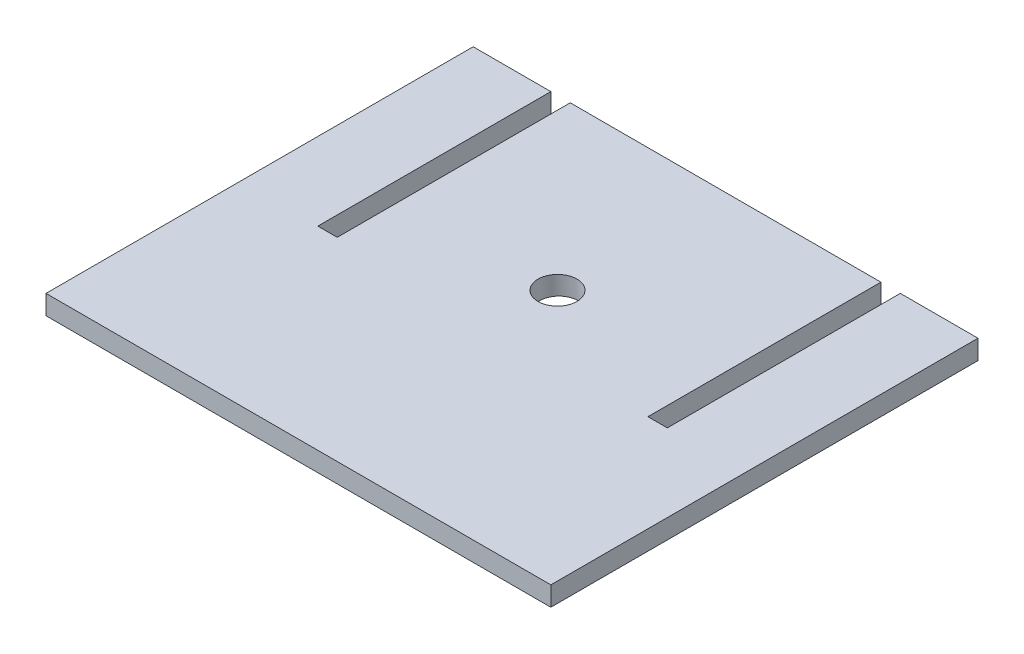
ISO-10303-21;
HEADER;
FILE_DESCRIPTION(('STEP AP214'),'2;1');
FILE_NAME('part.step','',(''),(''),'','','');
FILE_SCHEMA(('AUTOMOTIVE_DESIGN { 1 0 10303 214 1 1 1 1 }'));
ENDSEC;
DATA;
#1=APPLICATION_CONTEXT('core data for automotive mechanical design processes');
#2=APPLICATION_PROTOCOL_DEFINITION('international standard','automotive_design',2000,#1);
#3=PRODUCT_CONTEXT('',#1,'mechanical');
#4=PRODUCT('Part','Part','',(#3));
#5=PRODUCT_RELATED_PRODUCT_CATEGORY('part','',(#4));
#6=PRODUCT_DEFINITION_FORMATION('','',#4);
#7=PRODUCT_DEFINITION_CONTEXT('part definition',#1,'design');
#8=PRODUCT_DEFINITION('design','',#6,#7);
#9=PRODUCT_DEFINITION_SHAPE('','',#8);
#10=(LENGTH_UNIT() NAMED_UNIT(*) SI_UNIT(.MILLI.,.METRE.));
#11=(NAMED_UNIT(*) PLANE_ANGLE_UNIT() SI_UNIT($,.RADIAN.));
#12=(NAMED_UNIT(*) SI_UNIT($,.STERADIAN.) SOLID_ANGLE_UNIT());
#13=UNCERTAINTY_MEASURE_WITH_UNIT(LENGTH_MEASURE(1.E-05),#10,'distance_accuracy_value','');
#14=(GEOMETRIC_REPRESENTATION_CONTEXT(3) GLOBAL_UNCERTAINTY_ASSIGNED_CONTEXT((#13)) GLOBAL_UNIT_ASSIGNED_CONTEXT((#10,
#11,#12)) REPRESENTATION_CONTEXT('',''));
#15=CARTESIAN_POINT('',(0.,0.,0.));
#16=DIRECTION('',(0.,0.,1.));
#17=DIRECTION('',(1.,0.,0.));
#18=AXIS2_PLACEMENT_3D('',#15,#16,#17);
#19=CARTESIAN_POINT('',(-165.1,6.35,-139.7));
#20=DIRECTION('',(0.,0.,1.));
#21=DIRECTION('',(1.,0.,0.));
#22=AXIS2_PLACEMENT_3D('',#19,#20,#21);
#23=PLANE('',#22);
#24=DIRECTION('',(-1.,0.,0.));
#25=VECTOR('',#24,1.);
#26=CARTESIAN_POINT('',(-165.1,6.35,-139.7));
#27=LINE('',#26,#25);
#28=CARTESIAN_POINT('',(-114.3,6.35,-139.7));
#29=VERTEX_POINT('',#28);
#30=CARTESIAN_POINT('',(-165.1,6.35,-139.7));
#31=VERTEX_POINT('',#30);
#32=EDGE_CURVE('E233',#29,#31,#27,.T.);
#33=ORIENTED_EDGE('',*,*,#32,.F.);
#34=DIRECTION('',(0.,1.,0.));
#35=VECTOR('',#34,1.);
#36=CARTESIAN_POINT('',(-114.3,-6.35,-139.7));
#37=LINE('',#36,#35);
#38=CARTESIAN_POINT('',(-114.3,-6.35,-139.7));
#39=VERTEX_POINT('',#38);
#40=EDGE_CURVE('E212',#39,#29,#37,.T.);
#41=ORIENTED_EDGE('',*,*,#40,.F.);
#42=DIRECTION('',(-1.,0.,0.));
#43=VECTOR('',#42,1.);
#44=CARTESIAN_POINT('',(-165.1,-6.35,-139.7));
#45=LINE('',#44,#43);
#46=CARTESIAN_POINT('',(-165.1,-6.35,-139.7));
#47=VERTEX_POINT('',#46);
#48=EDGE_CURVE('E257',#39,#47,#45,.T.);
#49=ORIENTED_EDGE('',*,*,#48,.T.);
#50=DIRECTION('',(0.,-1.,0.));
#51=VECTOR('',#50,1.);
#52=CARTESIAN_POINT('',(-165.1,6.35,-139.7));
#53=LINE('',#52,#51);
#54=EDGE_CURVE('E239',#31,#47,#53,.T.);
#55=ORIENTED_EDGE('',*,*,#54,.F.);
#56=EDGE_LOOP('',(#33,#41,#49,#55));
#57=FACE_BOUND('',#56,.T.);
#58=ADVANCED_FACE('F44',(#57),#23,.F.);
#59=CARTESIAN_POINT('',(165.1,-6.35,-139.7));
#60=VERTEX_POINT('',#59);
#61=CARTESIAN_POINT('',(114.3,-6.35,-139.7));
#62=VERTEX_POINT('',#61);
#63=EDGE_CURVE('E204',#60,#62,#45,.T.);
#64=ORIENTED_EDGE('',*,*,#63,.T.);
#65=DIRECTION('',(0.,1.,0.));
#66=VECTOR('',#65,1.);
#67=CARTESIAN_POINT('',(114.3,-6.35,-139.7));
#68=LINE('',#67,#66);
#69=CARTESIAN_POINT('',(114.3,6.35,-139.7));
#70=VERTEX_POINT('',#69);
#71=EDGE_CURVE('E199',#62,#70,#68,.T.);
#72=ORIENTED_EDGE('',*,*,#71,.T.);
#73=CARTESIAN_POINT('',(165.1,6.35,-139.7));
#74=VERTEX_POINT('',#73);
#75=EDGE_CURVE('E231',#74,#70,#27,.T.);
#76=ORIENTED_EDGE('',*,*,#75,.F.);
#77=DIRECTION('',(0.,-1.,0.));
#78=VECTOR('',#77,1.);
#79=CARTESIAN_POINT('',(165.1,6.35,-139.7));
#80=LINE('',#79,#78);
#81=EDGE_CURVE('E203',#74,#60,#80,.T.);
#82=ORIENTED_EDGE('',*,*,#81,.T.);
#83=EDGE_LOOP('',(#64,#72,#76,#82));
#84=FACE_BOUND('',#83,.T.);
#85=ADVANCED_FACE('F281',(#84),#23,.F.);
#86=CARTESIAN_POINT('',(165.1,6.35,139.7));
#87=DIRECTION('',(-1.,0.,0.));
#88=DIRECTION('',(0.,0.,1.));
#89=AXIS2_PLACEMENT_3D('',#86,#87,#88);
#90=PLANE('',#89);
#91=DIRECTION('',(0.,0.,-1.));
#92=VECTOR('',#91,1.);
#93=CARTESIAN_POINT('',(165.1,-6.35,139.7));
#94=LINE('',#93,#92);
#95=CARTESIAN_POINT('',(165.1,-6.35,139.7));
#96=VERTEX_POINT('',#95);
#97=EDGE_CURVE('E238',#96,#60,#94,.T.);
#98=ORIENTED_EDGE('',*,*,#97,.T.);
#99=ORIENTED_EDGE('',*,*,#81,.F.);
#100=DIRECTION('',(0.,0.,-1.));
#101=VECTOR('',#100,1.);
#102=CARTESIAN_POINT('',(165.1,6.35,139.7));
#103=LINE('',#102,#101);
#104=CARTESIAN_POINT('',(165.1,6.35,139.7));
#105=VERTEX_POINT('',#104);
#106=EDGE_CURVE('E263',#105,#74,#103,.T.);
#107=ORIENTED_EDGE('',*,*,#106,.F.);
#108=DIRECTION('',(0.,-1.,0.));
#109=VECTOR('',#108,1.);
#110=CARTESIAN_POINT('',(165.1,6.35,139.7));
#111=LINE('',#110,#109);
#112=EDGE_CURVE('E247',#105,#96,#111,.T.);
#113=ORIENTED_EDGE('',*,*,#112,.T.);
#114=EDGE_LOOP('',(#98,#99,#107,#113));
#115=FACE_BOUND('',#114,.T.);
#116=ADVANCED_FACE('F278',(#115),#90,.F.);
#117=CARTESIAN_POINT('',(101.6,-6.35,-139.7));
#118=VERTEX_POINT('',#117);
#119=CARTESIAN_POINT('',(-101.6,-6.35,-139.7));
#120=VERTEX_POINT('',#119);
#121=EDGE_CURVE('E175',#118,#120,#45,.T.);
#122=ORIENTED_EDGE('',*,*,#121,.T.);
#123=DIRECTION('',(0.,1.,0.));
#124=VECTOR('',#123,1.);
#125=CARTESIAN_POINT('',(-101.6,-6.35,-139.7));
#126=LINE('',#125,#124);
#127=CARTESIAN_POINT('',(-101.6,6.35,-139.7));
#128=VERTEX_POINT('',#127);
#129=EDGE_CURVE('E79',#120,#128,#126,.T.);
#130=ORIENTED_EDGE('',*,*,#129,.T.);
#131=CARTESIAN_POINT('',(101.6,6.35,-139.7));
#132=VERTEX_POINT('',#131);
#133=EDGE_CURVE('E225',#132,#128,#27,.T.);
#134=ORIENTED_EDGE('',*,*,#133,.F.);
#135=DIRECTION('',(0.,1.,0.));
#136=VECTOR('',#135,1.);
#137=CARTESIAN_POINT('',(101.6,-6.35,-139.7));
#138=LINE('',#137,#136);
#139=EDGE_CURVE('E191',#118,#132,#138,.T.);
#140=ORIENTED_EDGE('',*,*,#139,.F.);
#141=EDGE_LOOP('',(#122,#130,#134,#140));
#142=FACE_BOUND('',#141,.T.);
#143=ADVANCED_FACE('F297',(#142),#23,.F.);
#144=CARTESIAN_POINT('',(-165.1,6.35,139.7));
#145=DIRECTION('',(1.,0.,0.));
#146=DIRECTION('',(0.,0.,-1.));
#147=AXIS2_PLACEMENT_3D('',#144,#145,#146);
#148=PLANE('',#147);
#149=DIRECTION('',(0.,0.,1.));
#150=VECTOR('',#149,1.);
#151=CARTESIAN_POINT('',(-165.1,-6.35,139.7));
#152=LINE('',#151,#150);
#153=CARTESIAN_POINT('',(-165.1,-6.35,139.7));
#154=VERTEX_POINT('',#153);
#155=EDGE_CURVE('E211',#47,#154,#152,.T.);
#156=ORIENTED_EDGE('',*,*,#155,.T.);
#157=DIRECTION('',(0.,-1.,0.));
#158=VECTOR('',#157,1.);
#159=CARTESIAN_POINT('',(-165.1,6.35,139.7));
#160=LINE('',#159,#158);
#161=CARTESIAN_POINT('',(-165.1,6.35,139.7));
#162=VERTEX_POINT('',#161);
#163=EDGE_CURVE('E243',#162,#154,#160,.T.);
#164=ORIENTED_EDGE('',*,*,#163,.F.);
#165=DIRECTION('',(0.,0.,1.));
#166=VECTOR('',#165,1.);
#167=CARTESIAN_POINT('',(-165.1,6.35,139.7));
#168=LINE('',#167,#166);
#169=EDGE_CURVE('E264',#31,#162,#168,.T.);
#170=ORIENTED_EDGE('',*,*,#169,.F.);
#171=ORIENTED_EDGE('',*,*,#54,.T.);
#172=EDGE_LOOP('',(#156,#164,#170,#171));
#173=FACE_BOUND('',#172,.T.);
#174=ADVANCED_FACE('F291',(#173),#148,.F.);
#175=CARTESIAN_POINT('',(-165.1,6.35,139.7));
#176=DIRECTION('',(0.,0.,-1.));
#177=DIRECTION('',(-1.,0.,0.));
#178=AXIS2_PLACEMENT_3D('',#175,#176,#177);
#179=PLANE('',#178);
#180=DIRECTION('',(1.,0.,0.));
#181=VECTOR('',#180,1.);
#182=CARTESIAN_POINT('',(-165.1,-6.35,139.7));
#183=LINE('',#182,#181);
#184=EDGE_CURVE('E242',#154,#96,#183,.T.);
#185=ORIENTED_EDGE('',*,*,#184,.T.);
#186=ORIENTED_EDGE('',*,*,#112,.F.);
#187=DIRECTION('',(1.,0.,0.));
#188=VECTOR('',#187,1.);
#189=CARTESIAN_POINT('',(-165.1,6.35,139.7));
#190=LINE('',#189,#188);
#191=EDGE_CURVE('E260',#162,#105,#190,.T.);
#192=ORIENTED_EDGE('',*,*,#191,.F.);
#193=ORIENTED_EDGE('',*,*,#163,.T.);
#194=EDGE_LOOP('',(#185,#186,#192,#193));
#195=FACE_BOUND('',#194,.T.);
#196=ADVANCED_FACE('F287',(#195),#179,.F.);
#197=CARTESIAN_POINT('',(0.,6.35,0.));
#198=DIRECTION('',(0.,-1.,0.));
#199=DIRECTION('',(0.,0.,-1.));
#200=AXIS2_PLACEMENT_3D('',#197,#198,#199);
#201=PLANE('',#200);
#202=CARTESIAN_POINT('',(0.420618124772805,6.34999999999999,-29.3287996232021));
#203=DIRECTION('',(0.,-1.,0.));
#204=DIRECTION('',(-0.0668404015347865,0.,0.99776367979731));
#205=AXIS2_PLACEMENT_3D('',#202,#203,#204);
#206=ELLIPSE('',#205,12.7300984739161,12.7000000000001);
#207=CARTESIAN_POINT('',(-0.430266768801122,6.34999999999999,-16.6271697256854));
#208=VERTEX_POINT('',#207);
#209=EDGE_CURVE('E11',#208,#208,#206,.F.);
#210=ORIENTED_EDGE('',*,*,#209,.F.);
#211=EDGE_LOOP('',(#210));
#212=FACE_BOUND('',#211,.T.);
#213=DIRECTION('',(1.,0.,0.));
#214=VECTOR('',#213,1.);
#215=CARTESIAN_POINT('',(-114.3,6.35,12.7));
#216=LINE('',#215,#214);
#217=CARTESIAN_POINT('',(-114.3,6.35,12.7));
#218=VERTEX_POINT('',#217);
#219=CARTESIAN_POINT('',(-101.6,6.35,12.7));
#220=VERTEX_POINT('',#219);
#221=EDGE_CURVE('E206',#218,#220,#216,.T.);
#222=ORIENTED_EDGE('',*,*,#221,.F.);
#223=DIRECTION('',(0.,0.,1.));
#224=VECTOR('',#223,1.);
#225=CARTESIAN_POINT('',(-114.3,6.35,-139.7));
#226=LINE('',#225,#224);
#227=EDGE_CURVE('E198',#29,#218,#226,.T.);
#228=ORIENTED_EDGE('',*,*,#227,.F.);
#229=ORIENTED_EDGE('',*,*,#32,.T.);
#230=ORIENTED_EDGE('',*,*,#169,.T.);
#231=ORIENTED_EDGE('',*,*,#191,.T.);
#232=ORIENTED_EDGE('',*,*,#106,.T.);
#233=ORIENTED_EDGE('',*,*,#75,.T.);
#234=DIRECTION('',(0.,0.,-1.));
#235=VECTOR('',#234,1.);
#236=CARTESIAN_POINT('',(114.3,6.35,-139.7));
#237=LINE('',#236,#235);
#238=CARTESIAN_POINT('',(114.3,6.35,12.7));
#239=VERTEX_POINT('',#238);
#240=EDGE_CURVE('E186',#239,#70,#237,.T.);
#241=ORIENTED_EDGE('',*,*,#240,.F.);
#242=DIRECTION('',(1.,0.,0.));
#243=VECTOR('',#242,1.);
#244=CARTESIAN_POINT('',(114.3,6.35,12.7));
#245=LINE('',#244,#243);
#246=CARTESIAN_POINT('',(101.6,6.35,12.7));
#247=VERTEX_POINT('',#246);
#248=EDGE_CURVE('E169',#247,#239,#245,.T.);
#249=ORIENTED_EDGE('',*,*,#248,.F.);
#250=DIRECTION('',(0.,0.,1.));
#251=VECTOR('',#250,1.);
#252=CARTESIAN_POINT('',(101.6,6.35,-139.7));
#253=LINE('',#252,#251);
#254=EDGE_CURVE('E166',#132,#247,#253,.T.);
#255=ORIENTED_EDGE('',*,*,#254,.F.);
#256=ORIENTED_EDGE('',*,*,#133,.T.);
#257=DIRECTION('',(0.,0.,-1.));
#258=VECTOR('',#257,1.);
#259=CARTESIAN_POINT('',(-101.6,6.35,-139.7));
#260=LINE('',#259,#258);
#261=EDGE_CURVE('E83',#220,#128,#260,.T.);
#262=ORIENTED_EDGE('',*,*,#261,.F.);
#263=EDGE_LOOP('',(#222,#228,#229,#230,#231,#232,#233,#241,#249,#255,#256,#262));
#264=FACE_BOUND('',#263,.T.);
#265=ADVANCED_FACE('F46',(#212,#264),#201,.F.);
#266=CARTESIAN_POINT('',(0.,-6.35,0.));
#267=DIRECTION('',(0.,-1.,0.));
#268=DIRECTION('',(0.,0.,-1.));
#269=AXIS2_PLACEMENT_3D('',#266,#267,#268);
#270=PLANE('',#269);
#271=CARTESIAN_POINT('',(0.47909515506259,-6.34999999999999,-30.2017186300574));
#272=DIRECTION('',(0.,-1.,0.));
#273=DIRECTION('',(-0.0668404015347865,0.,0.99776367979731));
#274=AXIS2_PLACEMENT_3D('',#271,#272,#273);
#275=ELLIPSE('',#274,12.7300984739161,12.7000000000001);
#276=CARTESIAN_POINT('',(-0.371789738511338,-6.34999999999999,-17.5000887325407));
#277=VERTEX_POINT('',#276);
#278=EDGE_CURVE('E221',#277,#277,#275,.F.);
#279=ORIENTED_EDGE('',*,*,#278,.T.);
#280=EDGE_LOOP('',(#279));
#281=FACE_BOUND('',#280,.T.);
#282=DIRECTION('',(0.,0.,1.));
#283=VECTOR('',#282,1.);
#284=CARTESIAN_POINT('',(-114.3,-6.35,-139.7));
#285=LINE('',#284,#283);
#286=CARTESIAN_POINT('',(-114.3,-6.35,12.7));
#287=VERTEX_POINT('',#286);
#288=EDGE_CURVE('E220',#39,#287,#285,.T.);
#289=ORIENTED_EDGE('',*,*,#288,.T.);
#290=DIRECTION('',(1.,0.,0.));
#291=VECTOR('',#290,1.);
#292=CARTESIAN_POINT('',(-114.3,-6.35,12.7));
#293=LINE('',#292,#291);
#294=CARTESIAN_POINT('',(-101.6,-6.35,12.7));
#295=VERTEX_POINT('',#294);
#296=EDGE_CURVE('E181',#287,#295,#293,.T.);
#297=ORIENTED_EDGE('',*,*,#296,.T.);
#298=DIRECTION('',(0.,0.,-1.));
#299=VECTOR('',#298,1.);
#300=CARTESIAN_POINT('',(-101.6,-6.35,-139.7));
#301=LINE('',#300,#299);
#302=EDGE_CURVE('E177',#295,#120,#301,.T.);
#303=ORIENTED_EDGE('',*,*,#302,.T.);
#304=ORIENTED_EDGE('',*,*,#121,.F.);
#305=DIRECTION('',(0.,0.,1.));
#306=VECTOR('',#305,1.);
#307=CARTESIAN_POINT('',(101.6,-6.35,-139.7));
#308=LINE('',#307,#306);
#309=CARTESIAN_POINT('',(101.6,-6.35,12.7));
#310=VERTEX_POINT('',#309);
#311=EDGE_CURVE('E160',#118,#310,#308,.T.);
#312=ORIENTED_EDGE('',*,*,#311,.T.);
#313=DIRECTION('',(1.,0.,0.));
#314=VECTOR('',#313,1.);
#315=CARTESIAN_POINT('',(114.3,-6.35,12.7));
#316=LINE('',#315,#314);
#317=CARTESIAN_POINT('',(114.3,-6.35,12.7));
#318=VERTEX_POINT('',#317);
#319=EDGE_CURVE('E147',#310,#318,#316,.T.);
#320=ORIENTED_EDGE('',*,*,#319,.T.);
#321=DIRECTION('',(0.,0.,-1.));
#322=VECTOR('',#321,1.);
#323=CARTESIAN_POINT('',(114.3,-6.35,-139.7));
#324=LINE('',#323,#322);
#325=EDGE_CURVE('E159',#318,#62,#324,.T.);
#326=ORIENTED_EDGE('',*,*,#325,.T.);
#327=ORIENTED_EDGE('',*,*,#63,.F.);
#328=ORIENTED_EDGE('',*,*,#97,.F.);
#329=ORIENTED_EDGE('',*,*,#184,.F.);
#330=ORIENTED_EDGE('',*,*,#155,.F.);
#331=ORIENTED_EDGE('',*,*,#48,.F.);
#332=EDGE_LOOP('',(#289,#297,#303,#304,#312,#320,#326,#327,#328,#329,#330,#331));
#333=FACE_BOUND('',#332,.T.);
#334=ADVANCED_FACE('F173',(#281,#333),#270,.T.);
#335=CARTESIAN_POINT('',(114.3,-6.35,-139.7));
#336=DIRECTION('',(1.,0.,0.));
#337=DIRECTION('',(0.,0.,-1.));
#338=AXIS2_PLACEMENT_3D('',#335,#336,#337);
#339=PLANE('',#338);
#340=ORIENTED_EDGE('',*,*,#240,.T.);
#341=ORIENTED_EDGE('',*,*,#71,.F.);
#342=ORIENTED_EDGE('',*,*,#325,.F.);
#343=DIRECTION('',(0.,1.,0.));
#344=VECTOR('',#343,1.);
#345=CARTESIAN_POINT('',(114.3,-6.35,12.7));
#346=LINE('',#345,#344);
#347=EDGE_CURVE('E153',#318,#239,#346,.T.);
#348=ORIENTED_EDGE('',*,*,#347,.T.);
#349=EDGE_LOOP('',(#340,#341,#342,#348));
#350=FACE_BOUND('',#349,.T.);
#351=ADVANCED_FACE('F283',(#350),#339,.F.);
#352=CARTESIAN_POINT('',(114.3,-6.35,12.7));
#353=DIRECTION('',(0.,0.,1.));
#354=DIRECTION('',(1.,0.,0.));
#355=AXIS2_PLACEMENT_3D('',#352,#353,#354);
#356=PLANE('',#355);
#357=ORIENTED_EDGE('',*,*,#248,.T.);
#358=ORIENTED_EDGE('',*,*,#347,.F.);
#359=ORIENTED_EDGE('',*,*,#319,.F.);
#360=DIRECTION('',(0.,1.,0.));
#361=VECTOR('',#360,1.);
#362=CARTESIAN_POINT('',(101.6,-6.35,12.7));
#363=LINE('',#362,#361);
#364=EDGE_CURVE('E151',#310,#247,#363,.T.);
#365=ORIENTED_EDGE('',*,*,#364,.T.);
#366=EDGE_LOOP('',(#357,#358,#359,#365));
#367=FACE_BOUND('',#366,.T.);
#368=ADVANCED_FACE('F150',(#367),#356,.F.);
#369=CARTESIAN_POINT('',(101.6,-6.35,-139.7));
#370=DIRECTION('',(-1.,0.,0.));
#371=DIRECTION('',(0.,0.,1.));
#372=AXIS2_PLACEMENT_3D('',#369,#370,#371);
#373=PLANE('',#372);
#374=ORIENTED_EDGE('',*,*,#254,.T.);
#375=ORIENTED_EDGE('',*,*,#364,.F.);
#376=ORIENTED_EDGE('',*,*,#311,.F.);
#377=ORIENTED_EDGE('',*,*,#139,.T.);
#378=EDGE_LOOP('',(#374,#375,#376,#377));
#379=FACE_BOUND('',#378,.T.);
#380=ADVANCED_FACE('F163',(#379),#373,.F.);
#381=CARTESIAN_POINT('',(-114.3,-6.35,-139.7));
#382=DIRECTION('',(-1.,0.,0.));
#383=DIRECTION('',(0.,0.,1.));
#384=AXIS2_PLACEMENT_3D('',#381,#382,#383);
#385=PLANE('',#384);
#386=ORIENTED_EDGE('',*,*,#227,.T.);
#387=DIRECTION('',(0.,1.,0.));
#388=VECTOR('',#387,1.);
#389=CARTESIAN_POINT('',(-114.3,-6.35,12.7));
#390=LINE('',#389,#388);
#391=EDGE_CURVE('E54',#287,#218,#390,.T.);
#392=ORIENTED_EDGE('',*,*,#391,.F.);
#393=ORIENTED_EDGE('',*,*,#288,.F.);
#394=ORIENTED_EDGE('',*,*,#40,.T.);
#395=EDGE_LOOP('',(#386,#392,#393,#394));
#396=FACE_BOUND('',#395,.T.);
#397=ADVANCED_FACE('F304',(#396),#385,.F.);
#398=CARTESIAN_POINT('',(-101.6,-6.35,-139.7));
#399=DIRECTION('',(1.,0.,0.));
#400=DIRECTION('',(0.,0.,-1.));
#401=AXIS2_PLACEMENT_3D('',#398,#399,#400);
#402=PLANE('',#401);
#403=ORIENTED_EDGE('',*,*,#261,.T.);
#404=ORIENTED_EDGE('',*,*,#129,.F.);
#405=ORIENTED_EDGE('',*,*,#302,.F.);
#406=DIRECTION('',(0.,1.,0.));
#407=VECTOR('',#406,1.);
#408=CARTESIAN_POINT('',(-101.6,-6.35,12.7));
#409=LINE('',#408,#407);
#410=EDGE_CURVE('E207',#295,#220,#409,.T.);
#411=ORIENTED_EDGE('',*,*,#410,.T.);
#412=EDGE_LOOP('',(#403,#404,#405,#411));
#413=FACE_BOUND('',#412,.T.);
#414=ADVANCED_FACE('F302',(#413),#402,.F.);
#415=CARTESIAN_POINT('',(-114.3,-6.35,12.7));
#416=DIRECTION('',(0.,0.,1.));
#417=DIRECTION('',(1.,0.,0.));
#418=AXIS2_PLACEMENT_3D('',#415,#416,#417);
#419=PLANE('',#418);
#420=ORIENTED_EDGE('',*,*,#221,.T.);
#421=ORIENTED_EDGE('',*,*,#410,.F.);
#422=ORIENTED_EDGE('',*,*,#296,.F.);
#423=ORIENTED_EDGE('',*,*,#391,.T.);
#424=EDGE_LOOP('',(#420,#421,#422,#423));
#425=FACE_BOUND('',#424,.T.);
#426=ADVANCED_FACE('F301',(#425),#419,.F.);
#427=CARTESIAN_POINT('',(0.803083946956162,-76.7136562366121,-35.038078702559));
#428=DIRECTION('',(-0.00459360392298645,0.9976356448477,0.0685712690003061));
#429=DIRECTION('',(0.,0.0685719924796838,-0.99764617066742));
#430=AXIS2_PLACEMENT_3D('',#427,#428,#429);
#431=CYLINDRICAL_SURFACE('',#430,12.7000000000001);
#432=ORIENTED_EDGE('',*,*,#278,.F.);
#433=EDGE_LOOP('',(#432));
#434=FACE_BOUND('',#433,.T.);
#435=ORIENTED_EDGE('',*,*,#209,.T.);
#436=EDGE_LOOP('',(#435));
#437=FACE_BOUND('',#436,.T.);
#438=ADVANCED_FACE('F310',(#434,#437),#431,.F.);
#439=CLOSED_SHELL('',(#58,#85,#116,#143,#174,#196,#265,#334,#351,#368,#380,#397,#414,#426,#438));
#440=MANIFOLD_SOLID_BREP('B2',#439);
#441=ADVANCED_BREP_SHAPE_REPRESENTATION('',(#18,#440),#14);
#442=SHAPE_DEFINITION_REPRESENTATION(#9,#441);
ENDSEC;
END-ISO-10303-21;
